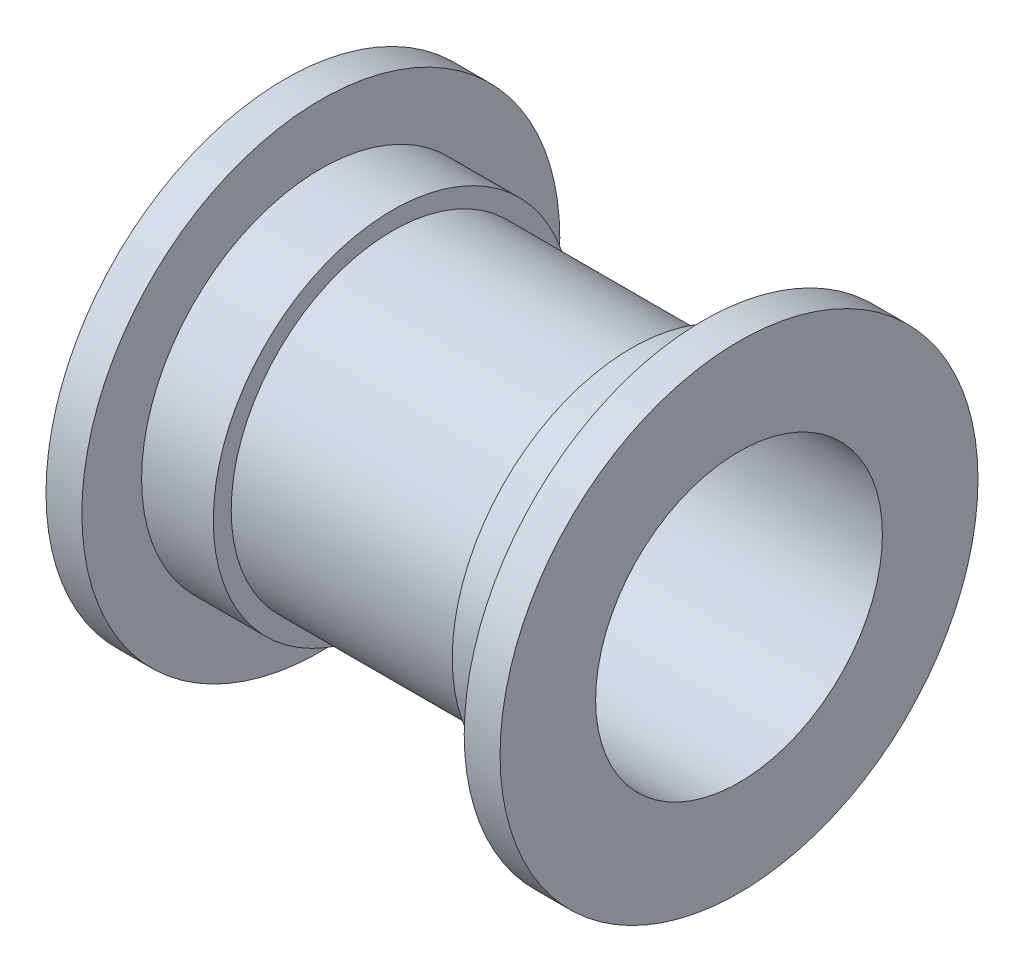
ISO-10303-21;
HEADER;
FILE_DESCRIPTION(('STEP AP214'),'2;1');
FILE_NAME('part.step','',(''),(''),'','','');
FILE_SCHEMA(('AUTOMOTIVE_DESIGN { 1 0 10303 214 1 1 1 1 }'));
ENDSEC;
DATA;
#1=APPLICATION_CONTEXT('core data for automotive mechanical design processes');
#2=APPLICATION_PROTOCOL_DEFINITION('international standard','automotive_design',2000,#1);
#3=PRODUCT_CONTEXT('',#1,'mechanical');
#4=PRODUCT('Part','Part','',(#3));
#5=PRODUCT_RELATED_PRODUCT_CATEGORY('part','',(#4));
#6=PRODUCT_DEFINITION_FORMATION('','',#4);
#7=PRODUCT_DEFINITION_CONTEXT('part definition',#1,'design');
#8=PRODUCT_DEFINITION('design','',#6,#7);
#9=PRODUCT_DEFINITION_SHAPE('','',#8);
#10=(LENGTH_UNIT() NAMED_UNIT(*) SI_UNIT(.MILLI.,.METRE.));
#11=(NAMED_UNIT(*) PLANE_ANGLE_UNIT() SI_UNIT($,.RADIAN.));
#12=(NAMED_UNIT(*) SI_UNIT($,.STERADIAN.) SOLID_ANGLE_UNIT());
#13=UNCERTAINTY_MEASURE_WITH_UNIT(LENGTH_MEASURE(1.E-05),#10,'distance_accuracy_value','');
#14=(GEOMETRIC_REPRESENTATION_CONTEXT(3) GLOBAL_UNCERTAINTY_ASSIGNED_CONTEXT((#13)) GLOBAL_UNIT_ASSIGNED_CONTEXT((#10,
#11,#12)) REPRESENTATION_CONTEXT('',''));
#15=CARTESIAN_POINT('',(0.,0.,0.));
#16=DIRECTION('',(0.,0.,1.));
#17=DIRECTION('',(1.,0.,0.));
#18=AXIS2_PLACEMENT_3D('',#15,#16,#17);
#19=CARTESIAN_POINT('',(15.875,23.8125,0.));
#20=DIRECTION('',(1.,0.,0.));
#21=DIRECTION('',(0.,0.,-1.));
#22=AXIS2_PLACEMENT_3D('',#19,#20,#21);
#23=PLANE('',#22);
#24=CARTESIAN_POINT('',(15.875,0.,0.));
#25=DIRECTION('',(-1.,0.,0.));
#26=DIRECTION('',(0.,0.,1.));
#27=AXIS2_PLACEMENT_3D('',#24,#25,#26);
#28=CIRCLE('',#27,21.43125);
#29=CARTESIAN_POINT('',(15.875,0.,21.43125));
#30=VERTEX_POINT('',#29);
#31=EDGE_CURVE('E88',#30,#30,#28,.T.);
#32=ORIENTED_EDGE('',*,*,#31,.F.);
#33=EDGE_LOOP('',(#32));
#34=FACE_BOUND('',#33,.T.);
#35=CARTESIAN_POINT('',(15.875,0.,0.));
#36=DIRECTION('',(-1.,0.,0.));
#37=DIRECTION('',(0.,0.,1.));
#38=AXIS2_PLACEMENT_3D('',#35,#36,#37);
#39=CIRCLE('',#38,23.8125);
#40=CARTESIAN_POINT('',(15.875,0.,23.8125));
#41=VERTEX_POINT('',#40);
#42=EDGE_CURVE('E10',#41,#41,#39,.T.);
#43=ORIENTED_EDGE('',*,*,#42,.T.);
#44=EDGE_LOOP('',(#43));
#45=FACE_BOUND('',#44,.T.);
#46=ADVANCED_FACE('F37',(#34,#45),#23,.F.);
#47=CARTESIAN_POINT('',(-30.1625,0.,0.));
#48=DIRECTION('',(-1.,0.,0.));
#49=DIRECTION('',(0.,0.,1.));
#50=AXIS2_PLACEMENT_3D('',#47,#48,#49);
#51=CYLINDRICAL_SURFACE('',#50,23.8125);
#52=ORIENTED_EDGE('',*,*,#42,.F.);
#53=EDGE_LOOP('',(#52));
#54=FACE_BOUND('',#53,.T.);
#55=CARTESIAN_POINT('',(25.4,0.,0.));
#56=DIRECTION('',(-1.,0.,0.));
#57=DIRECTION('',(0.,0.,1.));
#58=AXIS2_PLACEMENT_3D('',#55,#56,#57);
#59=CIRCLE('',#58,23.8125);
#60=CARTESIAN_POINT('',(25.4,0.,23.8125));
#61=VERTEX_POINT('',#60);
#62=EDGE_CURVE('E44',#61,#61,#59,.T.);
#63=ORIENTED_EDGE('',*,*,#62,.T.);
#64=EDGE_LOOP('',(#63));
#65=FACE_BOUND('',#64,.T.);
#66=ADVANCED_FACE('F96',(#54,#65),#51,.T.);
#67=CARTESIAN_POINT('',(25.4,31.75,0.));
#68=DIRECTION('',(1.,0.,0.));
#69=DIRECTION('',(0.,0.,-1.));
#70=AXIS2_PLACEMENT_3D('',#67,#68,#69);
#71=PLANE('',#70);
#72=ORIENTED_EDGE('',*,*,#62,.F.);
#73=EDGE_LOOP('',(#72));
#74=FACE_BOUND('',#73,.T.);
#75=CARTESIAN_POINT('',(25.4,0.,0.));
#76=DIRECTION('',(-1.,0.,0.));
#77=DIRECTION('',(0.,0.,1.));
#78=AXIS2_PLACEMENT_3D('',#75,#76,#77);
#79=CIRCLE('',#78,31.75);
#80=CARTESIAN_POINT('',(25.4,0.,31.75));
#81=VERTEX_POINT('',#80);
#82=EDGE_CURVE('E49',#81,#81,#79,.T.);
#83=ORIENTED_EDGE('',*,*,#82,.T.);
#84=EDGE_LOOP('',(#83));
#85=FACE_BOUND('',#84,.T.);
#86=ADVANCED_FACE('F100',(#74,#85),#71,.F.);
#87=CARTESIAN_POINT('',(-30.1625,0.,0.));
#88=DIRECTION('',(-1.,0.,0.));
#89=DIRECTION('',(0.,0.,1.));
#90=AXIS2_PLACEMENT_3D('',#87,#88,#89);
#91=CYLINDRICAL_SURFACE('',#90,31.75);
#92=ORIENTED_EDGE('',*,*,#82,.F.);
#93=EDGE_LOOP('',(#92));
#94=FACE_BOUND('',#93,.T.);
#95=CARTESIAN_POINT('',(30.1625,0.,0.));
#96=DIRECTION('',(-1.,0.,0.));
#97=DIRECTION('',(0.,0.,1.));
#98=AXIS2_PLACEMENT_3D('',#95,#96,#97);
#99=CIRCLE('',#98,31.75);
#100=CARTESIAN_POINT('',(30.1625,0.,31.75));
#101=VERTEX_POINT('',#100);
#102=EDGE_CURVE('E54',#101,#101,#99,.T.);
#103=ORIENTED_EDGE('',*,*,#102,.T.);
#104=EDGE_LOOP('',(#103));
#105=FACE_BOUND('',#104,.T.);
#106=ADVANCED_FACE('F105',(#94,#105),#91,.T.);
#107=CARTESIAN_POINT('',(30.1625,31.75,0.));
#108=DIRECTION('',(-1.,0.,0.));
#109=DIRECTION('',(0.,0.,1.));
#110=AXIS2_PLACEMENT_3D('',#107,#108,#109);
#111=PLANE('',#110);
#112=ORIENTED_EDGE('',*,*,#102,.F.);
#113=EDGE_LOOP('',(#112));
#114=FACE_BOUND('',#113,.T.);
#115=CARTESIAN_POINT('',(30.1625,0.,0.));
#116=DIRECTION('',(-1.,0.,0.));
#117=DIRECTION('',(0.,0.,1.));
#118=AXIS2_PLACEMENT_3D('',#115,#116,#117);
#119=CIRCLE('',#118,19.05);
#120=CARTESIAN_POINT('',(30.1625,0.,19.05));
#121=VERTEX_POINT('',#120);
#122=EDGE_CURVE('E60',#121,#121,#119,.T.);
#123=ORIENTED_EDGE('',*,*,#122,.T.);
#124=EDGE_LOOP('',(#123));
#125=FACE_BOUND('',#124,.T.);
#126=ADVANCED_FACE('F111',(#114,#125),#111,.F.);
#127=CARTESIAN_POINT('',(-30.1625,0.,0.));
#128=DIRECTION('',(-1.,0.,0.));
#129=DIRECTION('',(0.,0.,1.));
#130=AXIS2_PLACEMENT_3D('',#127,#128,#129);
#131=CYLINDRICAL_SURFACE('',#130,19.05);
#132=ORIENTED_EDGE('',*,*,#122,.F.);
#133=EDGE_LOOP('',(#132));
#134=FACE_BOUND('',#133,.T.);
#135=CARTESIAN_POINT('',(-30.1625,0.,0.));
#136=DIRECTION('',(-1.,0.,0.));
#137=DIRECTION('',(0.,0.,1.));
#138=AXIS2_PLACEMENT_3D('',#135,#136,#137);
#139=CIRCLE('',#138,19.05);
#140=CARTESIAN_POINT('',(-30.1625,0.,19.05));
#141=VERTEX_POINT('',#140);
#142=EDGE_CURVE('E64',#141,#141,#139,.T.);
#143=ORIENTED_EDGE('',*,*,#142,.T.);
#144=EDGE_LOOP('',(#143));
#145=FACE_BOUND('',#144,.T.);
#146=ADVANCED_FACE('F115',(#134,#145),#131,.F.);
#147=CARTESIAN_POINT('',(-30.1625,31.75,0.));
#148=DIRECTION('',(1.,0.,0.));
#149=DIRECTION('',(0.,0.,-1.));
#150=AXIS2_PLACEMENT_3D('',#147,#148,#149);
#151=PLANE('',#150);
#152=ORIENTED_EDGE('',*,*,#142,.F.);
#153=EDGE_LOOP('',(#152));
#154=FACE_BOUND('',#153,.T.);
#155=CARTESIAN_POINT('',(-30.1625,0.,0.));
#156=DIRECTION('',(-1.,0.,0.));
#157=DIRECTION('',(0.,0.,1.));
#158=AXIS2_PLACEMENT_3D('',#155,#156,#157);
#159=CIRCLE('',#158,31.75);
#160=CARTESIAN_POINT('',(-30.1625,0.,31.75));
#161=VERTEX_POINT('',#160);
#162=EDGE_CURVE('E68',#161,#161,#159,.T.);
#163=ORIENTED_EDGE('',*,*,#162,.T.);
#164=EDGE_LOOP('',(#163));
#165=FACE_BOUND('',#164,.T.);
#166=ADVANCED_FACE('F119',(#154,#165),#151,.F.);
#167=CARTESIAN_POINT('',(-30.1625,0.,0.));
#168=DIRECTION('',(-1.,0.,0.));
#169=DIRECTION('',(0.,0.,1.));
#170=AXIS2_PLACEMENT_3D('',#167,#168,#169);
#171=CYLINDRICAL_SURFACE('',#170,31.75);
#172=ORIENTED_EDGE('',*,*,#162,.F.);
#173=EDGE_LOOP('',(#172));
#174=FACE_BOUND('',#173,.T.);
#175=CARTESIAN_POINT('',(-25.4,0.,0.));
#176=DIRECTION('',(-1.,0.,0.));
#177=DIRECTION('',(0.,0.,1.));
#178=AXIS2_PLACEMENT_3D('',#175,#176,#177);
#179=CIRCLE('',#178,31.75);
#180=CARTESIAN_POINT('',(-25.4,0.,31.75));
#181=VERTEX_POINT('',#180);
#182=EDGE_CURVE('E72',#181,#181,#179,.T.);
#183=ORIENTED_EDGE('',*,*,#182,.T.);
#184=EDGE_LOOP('',(#183));
#185=FACE_BOUND('',#184,.T.);
#186=ADVANCED_FACE('F123',(#174,#185),#171,.T.);
#187=CARTESIAN_POINT('',(-25.4,23.8125,0.));
#188=DIRECTION('',(-1.,0.,0.));
#189=DIRECTION('',(0.,0.,1.));
#190=AXIS2_PLACEMENT_3D('',#187,#188,#189);
#191=PLANE('',#190);
#192=ORIENTED_EDGE('',*,*,#182,.F.);
#193=EDGE_LOOP('',(#192));
#194=FACE_BOUND('',#193,.T.);
#195=CARTESIAN_POINT('',(-25.4,0.,0.));
#196=DIRECTION('',(-1.,0.,0.));
#197=DIRECTION('',(0.,0.,1.));
#198=AXIS2_PLACEMENT_3D('',#195,#196,#197);
#199=CIRCLE('',#198,23.8125);
#200=CARTESIAN_POINT('',(-25.4,0.,23.8125));
#201=VERTEX_POINT('',#200);
#202=EDGE_CURVE('E76',#201,#201,#199,.T.);
#203=ORIENTED_EDGE('',*,*,#202,.T.);
#204=EDGE_LOOP('',(#203));
#205=FACE_BOUND('',#204,.T.);
#206=ADVANCED_FACE('F127',(#194,#205),#191,.F.);
#207=CARTESIAN_POINT('',(-30.1625,0.,0.));
#208=DIRECTION('',(-1.,0.,0.));
#209=DIRECTION('',(0.,0.,1.));
#210=AXIS2_PLACEMENT_3D('',#207,#208,#209);
#211=CYLINDRICAL_SURFACE('',#210,23.8125);
#212=ORIENTED_EDGE('',*,*,#202,.F.);
#213=EDGE_LOOP('',(#212));
#214=FACE_BOUND('',#213,.T.);
#215=CARTESIAN_POINT('',(-15.875,0.,0.));
#216=DIRECTION('',(-1.,0.,0.));
#217=DIRECTION('',(0.,0.,1.));
#218=AXIS2_PLACEMENT_3D('',#215,#216,#217);
#219=CIRCLE('',#218,23.8125);
#220=CARTESIAN_POINT('',(-15.875,0.,23.8125));
#221=VERTEX_POINT('',#220);
#222=EDGE_CURVE('E80',#221,#221,#219,.T.);
#223=ORIENTED_EDGE('',*,*,#222,.T.);
#224=EDGE_LOOP('',(#223));
#225=FACE_BOUND('',#224,.T.);
#226=ADVANCED_FACE('F131',(#214,#225),#211,.T.);
#227=CARTESIAN_POINT('',(-15.875,21.43125,0.));
#228=DIRECTION('',(-1.,0.,0.));
#229=DIRECTION('',(0.,0.,1.));
#230=AXIS2_PLACEMENT_3D('',#227,#228,#229);
#231=PLANE('',#230);
#232=ORIENTED_EDGE('',*,*,#222,.F.);
#233=EDGE_LOOP('',(#232));
#234=FACE_BOUND('',#233,.T.);
#235=CARTESIAN_POINT('',(-15.875,0.,0.));
#236=DIRECTION('',(-1.,0.,0.));
#237=DIRECTION('',(0.,0.,1.));
#238=AXIS2_PLACEMENT_3D('',#235,#236,#237);
#239=CIRCLE('',#238,21.43125);
#240=CARTESIAN_POINT('',(-15.875,0.,21.43125));
#241=VERTEX_POINT('',#240);
#242=EDGE_CURVE('E84',#241,#241,#239,.T.);
#243=ORIENTED_EDGE('',*,*,#242,.T.);
#244=EDGE_LOOP('',(#243));
#245=FACE_BOUND('',#244,.T.);
#246=ADVANCED_FACE('F135',(#234,#245),#231,.F.);
#247=CARTESIAN_POINT('',(-30.1625,0.,0.));
#248=DIRECTION('',(-1.,0.,0.));
#249=DIRECTION('',(0.,0.,1.));
#250=AXIS2_PLACEMENT_3D('',#247,#248,#249);
#251=CYLINDRICAL_SURFACE('',#250,21.43125);
#252=ORIENTED_EDGE('',*,*,#242,.F.);
#253=EDGE_LOOP('',(#252));
#254=FACE_BOUND('',#253,.T.);
#255=ORIENTED_EDGE('',*,*,#31,.T.);
#256=EDGE_LOOP('',(#255));
#257=FACE_BOUND('',#256,.T.);
#258=ADVANCED_FACE('F93',(#254,#257),#251,.T.);
#259=CLOSED_SHELL('',(#46,#66,#86,#106,#126,#146,#166,#186,#206,#226,#246,#258));
#260=MANIFOLD_SOLID_BREP('B2',#259);
#261=ADVANCED_BREP_SHAPE_REPRESENTATION('',(#18,#260),#14);
#262=SHAPE_DEFINITION_REPRESENTATION(#9,#261);
ENDSEC;
END-ISO-10303-21;
